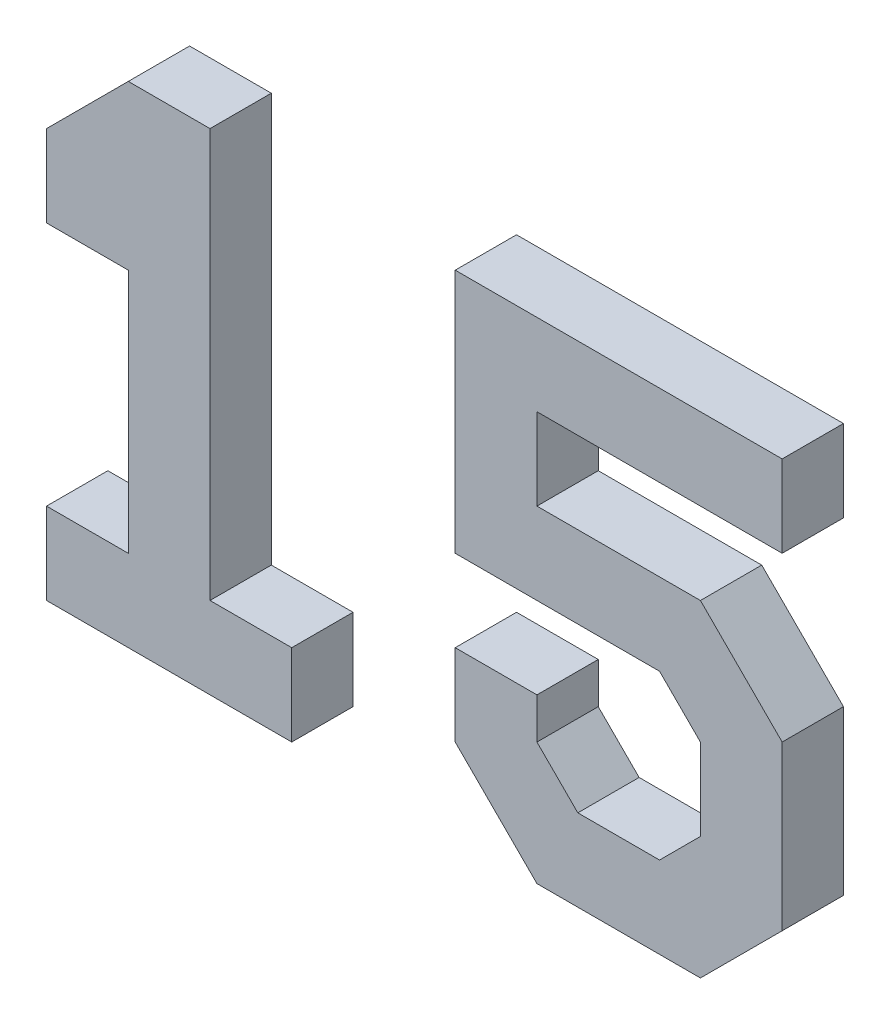
ISO-10303-21;
HEADER;
FILE_DESCRIPTION(('STEP AP214'),'2;1');
FILE_NAME('part.step','',(''),(''),'','','');
FILE_SCHEMA(('AUTOMOTIVE_DESIGN { 1 0 10303 214 1 1 1 1 }'));
ENDSEC;
DATA;
#1=APPLICATION_CONTEXT('core data for automotive mechanical design processes');
#2=APPLICATION_PROTOCOL_DEFINITION('international standard','automotive_design',2000,#1);
#3=PRODUCT_CONTEXT('',#1,'mechanical');
#4=PRODUCT('Part','Part','',(#3));
#5=PRODUCT_RELATED_PRODUCT_CATEGORY('part','',(#4));
#6=PRODUCT_DEFINITION_FORMATION('','',#4);
#7=PRODUCT_DEFINITION_CONTEXT('part definition',#1,'design');
#8=PRODUCT_DEFINITION('design','',#6,#7);
#9=PRODUCT_DEFINITION_SHAPE('','',#8);
#10=(LENGTH_UNIT() NAMED_UNIT(*) SI_UNIT(.MILLI.,.METRE.));
#11=(NAMED_UNIT(*) PLANE_ANGLE_UNIT() SI_UNIT($,.RADIAN.));
#12=(NAMED_UNIT(*) SI_UNIT($,.STERADIAN.) SOLID_ANGLE_UNIT());
#13=UNCERTAINTY_MEASURE_WITH_UNIT(LENGTH_MEASURE(1.E-05),#10,'distance_accuracy_value','');
#14=(GEOMETRIC_REPRESENTATION_CONTEXT(3) GLOBAL_UNCERTAINTY_ASSIGNED_CONTEXT((#13)) GLOBAL_UNIT_ASSIGNED_CONTEXT((#10,
#11,#12)) REPRESENTATION_CONTEXT('',''));
#15=CARTESIAN_POINT('',(0.,0.,0.));
#16=DIRECTION('',(0.,0.,1.));
#17=DIRECTION('',(1.,0.,0.));
#18=AXIS2_PLACEMENT_3D('',#15,#16,#17);
#19=CARTESIAN_POINT('',(90.0000000000001,120.,15.));
#20=DIRECTION('',(0.,1.,0.));
#21=DIRECTION('',(0.,0.,1.));
#22=AXIS2_PLACEMENT_3D('',#19,#20,#21);
#23=PLANE('',#22);
#24=DIRECTION('',(1.,0.,0.));
#25=VECTOR('',#24,1.);
#26=CARTESIAN_POINT('',(90.0000000000001,120.,0.));
#27=LINE('',#26,#25);
#28=CARTESIAN_POINT('',(100.000000000001,120.,0.));
#29=VERTEX_POINT('',#28);
#30=CARTESIAN_POINT('',(180.,120.,0.));
#31=VERTEX_POINT('',#30);
#32=EDGE_CURVE('E184',#29,#31,#27,.T.);
#33=ORIENTED_EDGE('',*,*,#32,.F.);
#34=DIRECTION('',(0.,0.,-1.));
#35=VECTOR('',#34,1.);
#36=CARTESIAN_POINT('',(100.000000000001,120.,15.));
#37=LINE('',#36,#35);
#38=CARTESIAN_POINT('',(100.000000000001,120.,15.));
#39=VERTEX_POINT('',#38);
#40=EDGE_CURVE('E12',#39,#29,#37,.T.);
#41=ORIENTED_EDGE('',*,*,#40,.F.);
#42=DIRECTION('',(1.,0.,0.));
#43=VECTOR('',#42,1.);
#44=CARTESIAN_POINT('',(90.0000000000001,120.,15.));
#45=LINE('',#44,#43);
#46=CARTESIAN_POINT('',(180.,120.,15.));
#47=VERTEX_POINT('',#46);
#48=EDGE_CURVE('E244',#39,#47,#45,.T.);
#49=ORIENTED_EDGE('',*,*,#48,.T.);
#50=DIRECTION('',(0.,0.,-1.));
#51=VECTOR('',#50,1.);
#52=CARTESIAN_POINT('',(180.,120.,15.));
#53=LINE('',#52,#51);
#54=EDGE_CURVE('E185',#47,#31,#53,.T.);
#55=ORIENTED_EDGE('',*,*,#54,.T.);
#56=EDGE_LOOP('',(#33,#41,#49,#55));
#57=FACE_BOUND('',#56,.T.);
#58=ADVANCED_FACE('F40',(#57),#23,.T.);
#59=CARTESIAN_POINT('',(99.9999999999994,-108.4090653048,15.));
#60=DIRECTION('',(-1.,0.,0.));
#61=DIRECTION('',(0.,-1.,0.));
#62=AXIS2_PLACEMENT_3D('',#59,#60,#61);
#63=PLANE('',#62);
#64=DIRECTION('',(0.,1.,0.));
#65=VECTOR('',#64,1.);
#66=CARTESIAN_POINT('',(99.9999999999994,-108.4090653048,0.));
#67=LINE('',#66,#65);
#68=CARTESIAN_POINT('',(100.000000000001,60.,0.));
#69=VERTEX_POINT('',#68);
#70=EDGE_CURVE('E178',#69,#29,#67,.T.);
#71=ORIENTED_EDGE('',*,*,#70,.F.);
#72=DIRECTION('',(0.,0.,-1.));
#73=VECTOR('',#72,1.);
#74=CARTESIAN_POINT('',(100.000000000001,60.,15.));
#75=LINE('',#74,#73);
#76=CARTESIAN_POINT('',(100.000000000001,60.,15.));
#77=VERTEX_POINT('',#76);
#78=EDGE_CURVE('E47',#77,#69,#75,.T.);
#79=ORIENTED_EDGE('',*,*,#78,.F.);
#80=DIRECTION('',(0.,1.,0.));
#81=VECTOR('',#80,1.);
#82=CARTESIAN_POINT('',(99.9999999999994,-108.4090653048,15.));
#83=LINE('',#82,#81);
#84=EDGE_CURVE('E180',#77,#39,#83,.T.);
#85=ORIENTED_EDGE('',*,*,#84,.T.);
#86=ORIENTED_EDGE('',*,*,#40,.T.);
#87=EDGE_LOOP('',(#71,#79,#85,#86));
#88=FACE_BOUND('',#87,.T.);
#89=ADVANCED_FACE('F176',(#88),#63,.T.);
#90=CARTESIAN_POINT('',(90.,60.,15.));
#91=DIRECTION('',(0.,1.,0.));
#92=DIRECTION('',(-1.,0.,0.));
#93=AXIS2_PLACEMENT_3D('',#90,#91,#92);
#94=PLANE('',#93);
#95=DIRECTION('',(1.,0.,0.));
#96=VECTOR('',#95,1.);
#97=CARTESIAN_POINT('',(90.,60.,0.));
#98=LINE('',#97,#96);
#99=CARTESIAN_POINT('',(150.,60.,0.));
#100=VERTEX_POINT('',#99);
#101=EDGE_CURVE('E193',#69,#100,#98,.T.);
#102=ORIENTED_EDGE('',*,*,#101,.T.);
#103=DIRECTION('',(0.,0.,-1.));
#104=VECTOR('',#103,1.);
#105=CARTESIAN_POINT('',(150.,60.,15.));
#106=LINE('',#105,#104);
#107=CARTESIAN_POINT('',(150.,60.,15.));
#108=VERTEX_POINT('',#107);
#109=EDGE_CURVE('E326',#108,#100,#106,.T.);
#110=ORIENTED_EDGE('',*,*,#109,.F.);
#111=DIRECTION('',(1.,0.,0.));
#112=VECTOR('',#111,1.);
#113=CARTESIAN_POINT('',(90.,60.,15.));
#114=LINE('',#113,#112);
#115=EDGE_CURVE('E247',#77,#108,#114,.T.);
#116=ORIENTED_EDGE('',*,*,#115,.F.);
#117=ORIENTED_EDGE('',*,*,#78,.T.);
#118=EDGE_LOOP('',(#102,#110,#116,#117));
#119=FACE_BOUND('',#118,.T.);
#120=ADVANCED_FACE('F330',(#119),#94,.F.);
#121=CARTESIAN_POINT('',(204.2045326524,5.79546734760004,15.));
#122=DIRECTION('',(0.707106781186548,0.707106781186547,0.));
#123=DIRECTION('',(-0.707106781186547,0.707106781186548,0.));
#124=AXIS2_PLACEMENT_3D('',#121,#122,#123);
#125=PLANE('',#124);
#126=DIRECTION('',(0.707106781186547,-0.707106781186548,0.));
#127=VECTOR('',#126,1.);
#128=CARTESIAN_POINT('',(204.2045326524,5.79546734760004,0.));
#129=LINE('',#128,#127);
#130=CARTESIAN_POINT('',(160.,50.,0.));
#131=VERTEX_POINT('',#130);
#132=EDGE_CURVE('E195',#100,#131,#129,.T.);
#133=ORIENTED_EDGE('',*,*,#132,.T.);
#134=DIRECTION('',(0.,0.,-1.));
#135=VECTOR('',#134,1.);
#136=CARTESIAN_POINT('',(160.,50.,15.));
#137=LINE('',#136,#135);
#138=CARTESIAN_POINT('',(160.,50.,15.));
#139=VERTEX_POINT('',#138);
#140=EDGE_CURVE('E324',#139,#131,#137,.T.);
#141=ORIENTED_EDGE('',*,*,#140,.F.);
#142=DIRECTION('',(0.707106781186547,-0.707106781186548,0.));
#143=VECTOR('',#142,1.);
#144=CARTESIAN_POINT('',(204.2045326524,5.79546734760004,15.));
#145=LINE('',#144,#143);
#146=EDGE_CURVE('E249',#108,#139,#145,.T.);
#147=ORIENTED_EDGE('',*,*,#146,.F.);
#148=ORIENTED_EDGE('',*,*,#109,.T.);
#149=EDGE_LOOP('',(#133,#141,#147,#148));
#150=FACE_BOUND('',#149,.T.);
#151=ADVANCED_FACE('F352',(#150),#125,.F.);
#152=CARTESIAN_POINT('',(160.,-108.4090653048,15.));
#153=DIRECTION('',(-1.,0.,0.));
#154=DIRECTION('',(0.,-1.,0.));
#155=AXIS2_PLACEMENT_3D('',#152,#153,#154);
#156=PLANE('',#155);
#157=DIRECTION('',(0.,1.,0.));
#158=VECTOR('',#157,1.);
#159=CARTESIAN_POINT('',(160.,-108.4090653048,0.));
#160=LINE('',#159,#158);
#161=CARTESIAN_POINT('',(160.,30.,0.));
#162=VERTEX_POINT('',#161);
#163=EDGE_CURVE('E200',#162,#131,#160,.T.);
#164=ORIENTED_EDGE('',*,*,#163,.F.);
#165=DIRECTION('',(0.,0.,-1.));
#166=VECTOR('',#165,1.);
#167=CARTESIAN_POINT('',(160.,30.,15.));
#168=LINE('',#167,#166);
#169=CARTESIAN_POINT('',(160.,30.,15.));
#170=VERTEX_POINT('',#169);
#171=EDGE_CURVE('E322',#170,#162,#168,.T.);
#172=ORIENTED_EDGE('',*,*,#171,.F.);
#173=DIRECTION('',(0.,1.,0.));
#174=VECTOR('',#173,1.);
#175=CARTESIAN_POINT('',(160.,-108.4090653048,15.));
#176=LINE('',#175,#174);
#177=EDGE_CURVE('E251',#170,#139,#176,.T.);
#178=ORIENTED_EDGE('',*,*,#177,.T.);
#179=ORIENTED_EDGE('',*,*,#140,.T.);
#180=EDGE_LOOP('',(#164,#172,#178,#179));
#181=FACE_BOUND('',#180,.T.);
#182=ADVANCED_FACE('F357',(#181),#156,.T.);
#183=CARTESIAN_POINT('',(55.7954673476001,-74.2045326523998,15.));
#184=DIRECTION('',(-0.707106781186547,0.707106781186548,0.));
#185=DIRECTION('',(-0.707106781186548,-0.707106781186547,0.));
#186=AXIS2_PLACEMENT_3D('',#183,#184,#185);
#187=PLANE('',#186);
#188=DIRECTION('',(0.707106781186548,0.707106781186547,0.));
#189=VECTOR('',#188,1.);
#190=CARTESIAN_POINT('',(55.7954673476001,-74.2045326523998,0.));
#191=LINE('',#190,#189);
#192=CARTESIAN_POINT('',(150.,20.,0.));
#193=VERTEX_POINT('',#192);
#194=EDGE_CURVE('E203',#193,#162,#191,.T.);
#195=ORIENTED_EDGE('',*,*,#194,.F.);
#196=DIRECTION('',(0.,0.,-1.));
#197=VECTOR('',#196,1.);
#198=CARTESIAN_POINT('',(150.,20.,15.));
#199=LINE('',#198,#197);
#200=CARTESIAN_POINT('',(150.,20.,15.));
#201=VERTEX_POINT('',#200);
#202=EDGE_CURVE('E320',#201,#193,#199,.T.);
#203=ORIENTED_EDGE('',*,*,#202,.F.);
#204=DIRECTION('',(0.707106781186548,0.707106781186547,0.));
#205=VECTOR('',#204,1.);
#206=CARTESIAN_POINT('',(55.7954673476001,-74.2045326523998,15.));
#207=LINE('',#206,#205);
#208=EDGE_CURVE('E254',#201,#170,#207,.T.);
#209=ORIENTED_EDGE('',*,*,#208,.T.);
#210=ORIENTED_EDGE('',*,*,#171,.T.);
#211=EDGE_LOOP('',(#195,#203,#209,#210));
#212=FACE_BOUND('',#211,.T.);
#213=ADVANCED_FACE('F361',(#212),#187,.T.);
#214=CARTESIAN_POINT('',(90.0000000000001,20.,15.));
#215=DIRECTION('',(0.,1.,0.));
#216=DIRECTION('',(-1.,0.,0.));
#217=AXIS2_PLACEMENT_3D('',#214,#215,#216);
#218=PLANE('',#217);
#219=DIRECTION('',(1.,0.,0.));
#220=VECTOR('',#219,1.);
#221=CARTESIAN_POINT('',(90.0000000000001,20.,0.));
#222=LINE('',#221,#220);
#223=CARTESIAN_POINT('',(130.,20.,0.));
#224=VERTEX_POINT('',#223);
#225=EDGE_CURVE('E206',#224,#193,#222,.T.);
#226=ORIENTED_EDGE('',*,*,#225,.F.);
#227=DIRECTION('',(0.,0.,-1.));
#228=VECTOR('',#227,1.);
#229=CARTESIAN_POINT('',(130.,20.,15.));
#230=LINE('',#229,#228);
#231=CARTESIAN_POINT('',(130.,20.,15.));
#232=VERTEX_POINT('',#231);
#233=EDGE_CURVE('E318',#232,#224,#230,.T.);
#234=ORIENTED_EDGE('',*,*,#233,.F.);
#235=DIRECTION('',(1.,0.,0.));
#236=VECTOR('',#235,1.);
#237=CARTESIAN_POINT('',(90.0000000000001,20.,15.));
#238=LINE('',#237,#236);
#239=EDGE_CURVE('E257',#232,#201,#238,.T.);
#240=ORIENTED_EDGE('',*,*,#239,.T.);
#241=ORIENTED_EDGE('',*,*,#202,.T.);
#242=EDGE_LOOP('',(#226,#234,#240,#241));
#243=FACE_BOUND('',#242,.T.);
#244=ADVANCED_FACE('F365',(#243),#218,.T.);
#245=CARTESIAN_POINT('',(174.2045326524,-24.2045326523998,15.));
#246=DIRECTION('',(0.707106781186547,0.707106781186548,0.));
#247=DIRECTION('',(-0.707106781186548,0.707106781186547,0.));
#248=AXIS2_PLACEMENT_3D('',#245,#246,#247);
#249=PLANE('',#248);
#250=DIRECTION('',(0.707106781186548,-0.707106781186547,0.));
#251=VECTOR('',#250,1.);
#252=CARTESIAN_POINT('',(174.2045326524,-24.2045326523998,0.));
#253=LINE('',#252,#251);
#254=CARTESIAN_POINT('',(120.,30.,0.));
#255=VERTEX_POINT('',#254);
#256=EDGE_CURVE('E209',#255,#224,#253,.T.);
#257=ORIENTED_EDGE('',*,*,#256,.F.);
#258=DIRECTION('',(0.,0.,-1.));
#259=VECTOR('',#258,1.);
#260=CARTESIAN_POINT('',(120.,30.,15.));
#261=LINE('',#260,#259);
#262=CARTESIAN_POINT('',(120.,30.,15.));
#263=VERTEX_POINT('',#262);
#264=EDGE_CURVE('E316',#263,#255,#261,.T.);
#265=ORIENTED_EDGE('',*,*,#264,.F.);
#266=DIRECTION('',(0.707106781186548,-0.707106781186547,0.));
#267=VECTOR('',#266,1.);
#268=CARTESIAN_POINT('',(174.2045326524,-24.2045326523998,15.));
#269=LINE('',#268,#267);
#270=EDGE_CURVE('E260',#263,#232,#269,.T.);
#271=ORIENTED_EDGE('',*,*,#270,.T.);
#272=ORIENTED_EDGE('',*,*,#233,.T.);
#273=EDGE_LOOP('',(#257,#265,#271,#272));
#274=FACE_BOUND('',#273,.T.);
#275=ADVANCED_FACE('F369',(#274),#249,.T.);
#276=CARTESIAN_POINT('',(120.,-108.4090653048,15.));
#277=DIRECTION('',(-1.,0.,0.));
#278=DIRECTION('',(0.,0.,1.));
#279=AXIS2_PLACEMENT_3D('',#276,#277,#278);
#280=PLANE('',#279);
#281=DIRECTION('',(0.,1.,0.));
#282=VECTOR('',#281,1.);
#283=CARTESIAN_POINT('',(120.,-108.4090653048,0.));
#284=LINE('',#283,#282);
#285=CARTESIAN_POINT('',(120.,40.,0.));
#286=VERTEX_POINT('',#285);
#287=EDGE_CURVE('E212',#255,#286,#284,.T.);
#288=ORIENTED_EDGE('',*,*,#287,.T.);
#289=DIRECTION('',(0.,0.,-1.));
#290=VECTOR('',#289,1.);
#291=CARTESIAN_POINT('',(120.,40.,15.));
#292=LINE('',#291,#290);
#293=CARTESIAN_POINT('',(120.,40.,15.));
#294=VERTEX_POINT('',#293);
#295=EDGE_CURVE('E314',#294,#286,#292,.T.);
#296=ORIENTED_EDGE('',*,*,#295,.F.);
#297=DIRECTION('',(0.,1.,0.));
#298=VECTOR('',#297,1.);
#299=CARTESIAN_POINT('',(120.,-108.4090653048,15.));
#300=LINE('',#299,#298);
#301=EDGE_CURVE('E263',#263,#294,#300,.T.);
#302=ORIENTED_EDGE('',*,*,#301,.F.);
#303=ORIENTED_EDGE('',*,*,#264,.T.);
#304=EDGE_LOOP('',(#288,#296,#302,#303));
#305=FACE_BOUND('',#304,.T.);
#306=ADVANCED_FACE('F373',(#305),#280,.F.);
#307=CARTESIAN_POINT('',(90.,40.,15.));
#308=DIRECTION('',(0.,1.,0.));
#309=DIRECTION('',(-1.,0.,0.));
#310=AXIS2_PLACEMENT_3D('',#307,#308,#309);
#311=PLANE('',#310);
#312=DIRECTION('',(1.,0.,0.));
#313=VECTOR('',#312,1.);
#314=CARTESIAN_POINT('',(90.,40.,0.));
#315=LINE('',#314,#313);
#316=CARTESIAN_POINT('',(100.000000000001,40.,0.));
#317=VERTEX_POINT('',#316);
#318=EDGE_CURVE('E215',#317,#286,#315,.T.);
#319=ORIENTED_EDGE('',*,*,#318,.F.);
#320=DIRECTION('',(0.,0.,-1.));
#321=VECTOR('',#320,1.);
#322=CARTESIAN_POINT('',(100.000000000001,40.,15.));
#323=LINE('',#322,#321);
#324=CARTESIAN_POINT('',(100.000000000001,40.,15.));
#325=VERTEX_POINT('',#324);
#326=EDGE_CURVE('E312',#325,#317,#323,.T.);
#327=ORIENTED_EDGE('',*,*,#326,.F.);
#328=DIRECTION('',(1.,0.,0.));
#329=VECTOR('',#328,1.);
#330=CARTESIAN_POINT('',(90.,40.,15.));
#331=LINE('',#330,#329);
#332=EDGE_CURVE('E265',#325,#294,#331,.T.);
#333=ORIENTED_EDGE('',*,*,#332,.T.);
#334=ORIENTED_EDGE('',*,*,#295,.T.);
#335=EDGE_LOOP('',(#319,#327,#333,#334));
#336=FACE_BOUND('',#335,.T.);
#337=ADVANCED_FACE('F377',(#336),#311,.T.);
#338=CARTESIAN_POINT('',(99.9999999999994,-108.4090653048,15.));
#339=DIRECTION('',(-1.,0.,0.));
#340=DIRECTION('',(0.,-1.,0.));
#341=AXIS2_PLACEMENT_3D('',#338,#339,#340);
#342=PLANE('',#341);
#343=DIRECTION('',(0.,1.,0.));
#344=VECTOR('',#343,1.);
#345=CARTESIAN_POINT('',(99.9999999999994,-108.4090653048,0.));
#346=LINE('',#345,#344);
#347=CARTESIAN_POINT('',(100.,20.,0.));
#348=VERTEX_POINT('',#347);
#349=EDGE_CURVE('E218',#348,#317,#346,.T.);
#350=ORIENTED_EDGE('',*,*,#349,.F.);
#351=DIRECTION('',(0.,0.,-1.));
#352=VECTOR('',#351,1.);
#353=CARTESIAN_POINT('',(100.,20.,15.));
#354=LINE('',#353,#352);
#355=CARTESIAN_POINT('',(100.,20.,15.));
#356=VERTEX_POINT('',#355);
#357=EDGE_CURVE('E310',#356,#348,#354,.T.);
#358=ORIENTED_EDGE('',*,*,#357,.F.);
#359=DIRECTION('',(0.,1.,0.));
#360=VECTOR('',#359,1.);
#361=CARTESIAN_POINT('',(99.9999999999994,-108.4090653048,15.));
#362=LINE('',#361,#360);
#363=EDGE_CURVE('E268',#356,#325,#362,.T.);
#364=ORIENTED_EDGE('',*,*,#363,.T.);
#365=ORIENTED_EDGE('',*,*,#326,.T.);
#366=EDGE_LOOP('',(#350,#358,#364,#365));
#367=FACE_BOUND('',#366,.T.);
#368=ADVANCED_FACE('F381',(#367),#342,.T.);
#369=CARTESIAN_POINT('',(159.2045326524,-39.2045326524011,15.));
#370=DIRECTION('',(-0.707106781186555,-0.70710678118654,0.));
#371=DIRECTION('',(0.70710678118654,-0.707106781186555,0.));
#372=AXIS2_PLACEMENT_3D('',#369,#370,#371);
#373=PLANE('',#372);
#374=DIRECTION('',(-0.70710678118654,0.707106781186555,0.));
#375=VECTOR('',#374,1.);
#376=CARTESIAN_POINT('',(159.2045326524,-39.2045326524011,0.));
#377=LINE('',#376,#375);
#378=CARTESIAN_POINT('',(120.,0.,0.));
#379=VERTEX_POINT('',#378);
#380=EDGE_CURVE('E221',#379,#348,#377,.T.);
#381=ORIENTED_EDGE('',*,*,#380,.F.);
#382=DIRECTION('',(0.,0.,-1.));
#383=VECTOR('',#382,1.);
#384=CARTESIAN_POINT('',(120.,0.,15.));
#385=LINE('',#384,#383);
#386=CARTESIAN_POINT('',(120.,0.,15.));
#387=VERTEX_POINT('',#386);
#388=EDGE_CURVE('E308',#387,#379,#385,.T.);
#389=ORIENTED_EDGE('',*,*,#388,.F.);
#390=DIRECTION('',(-0.70710678118654,0.707106781186555,0.));
#391=VECTOR('',#390,1.);
#392=CARTESIAN_POINT('',(159.2045326524,-39.2045326524011,15.));
#393=LINE('',#392,#391);
#394=EDGE_CURVE('E271',#387,#356,#393,.T.);
#395=ORIENTED_EDGE('',*,*,#394,.T.);
#396=ORIENTED_EDGE('',*,*,#357,.T.);
#397=EDGE_LOOP('',(#381,#389,#395,#396));
#398=FACE_BOUND('',#397,.T.);
#399=ADVANCED_FACE('F385',(#398),#373,.T.);
#400=CARTESIAN_POINT('',(90.0000000000001,0.,15.));
#401=DIRECTION('',(0.,1.,0.));
#402=DIRECTION('',(0.,0.,1.));
#403=AXIS2_PLACEMENT_3D('',#400,#401,#402);
#404=PLANE('',#403);
#405=DIRECTION('',(1.,0.,0.));
#406=VECTOR('',#405,1.);
#407=CARTESIAN_POINT('',(90.0000000000001,0.,0.));
#408=LINE('',#407,#406);
#409=CARTESIAN_POINT('',(160.,0.,0.));
#410=VERTEX_POINT('',#409);
#411=EDGE_CURVE('E224',#379,#410,#408,.T.);
#412=ORIENTED_EDGE('',*,*,#411,.T.);
#413=DIRECTION('',(0.,0.,-1.));
#414=VECTOR('',#413,1.);
#415=CARTESIAN_POINT('',(160.,0.,15.));
#416=LINE('',#415,#414);
#417=CARTESIAN_POINT('',(160.,0.,15.));
#418=VERTEX_POINT('',#417);
#419=EDGE_CURVE('E306',#418,#410,#416,.T.);
#420=ORIENTED_EDGE('',*,*,#419,.F.);
#421=DIRECTION('',(1.,0.,0.));
#422=VECTOR('',#421,1.);
#423=CARTESIAN_POINT('',(90.0000000000001,0.,15.));
#424=LINE('',#423,#422);
#425=EDGE_CURVE('E274',#387,#418,#424,.T.);
#426=ORIENTED_EDGE('',*,*,#425,.F.);
#427=ORIENTED_EDGE('',*,*,#388,.T.);
#428=EDGE_LOOP('',(#412,#420,#426,#427));
#429=FACE_BOUND('',#428,.T.);
#430=ADVANCED_FACE('F389',(#429),#404,.F.);
#431=CARTESIAN_POINT('',(70.7954673475994,-89.2045326523987,15.));
#432=DIRECTION('',(0.70710678118654,-0.707106781186555,0.));
#433=DIRECTION('',(0.707106781186555,0.70710678118654,0.));
#434=AXIS2_PLACEMENT_3D('',#431,#432,#433);
#435=PLANE('',#434);
#436=DIRECTION('',(-0.707106781186555,-0.70710678118654,0.));
#437=VECTOR('',#436,1.);
#438=CARTESIAN_POINT('',(70.7954673475994,-89.2045326523987,0.));
#439=LINE('',#438,#437);
#440=CARTESIAN_POINT('',(180.,20.,0.));
#441=VERTEX_POINT('',#440);
#442=EDGE_CURVE('E227',#441,#410,#439,.T.);
#443=ORIENTED_EDGE('',*,*,#442,.F.);
#444=DIRECTION('',(0.,0.,-1.));
#445=VECTOR('',#444,1.);
#446=CARTESIAN_POINT('',(180.,20.,15.));
#447=LINE('',#446,#445);
#448=CARTESIAN_POINT('',(180.,20.,15.));
#449=VERTEX_POINT('',#448);
#450=EDGE_CURVE('E304',#449,#441,#447,.T.);
#451=ORIENTED_EDGE('',*,*,#450,.F.);
#452=DIRECTION('',(-0.707106781186555,-0.70710678118654,0.));
#453=VECTOR('',#452,1.);
#454=CARTESIAN_POINT('',(70.7954673475994,-89.2045326523987,15.));
#455=LINE('',#454,#453);
#456=EDGE_CURVE('E276',#449,#418,#455,.T.);
#457=ORIENTED_EDGE('',*,*,#456,.T.);
#458=ORIENTED_EDGE('',*,*,#419,.T.);
#459=EDGE_LOOP('',(#443,#451,#457,#458));
#460=FACE_BOUND('',#459,.T.);
#461=ADVANCED_FACE('F393',(#460),#435,.T.);
#462=CARTESIAN_POINT('',(180.000000000003,-108.409065304798,15.));
#463=DIRECTION('',(-1.,0.,0.));
#464=DIRECTION('',(0.,-1.,0.));
#465=AXIS2_PLACEMENT_3D('',#462,#463,#464);
#466=PLANE('',#465);
#467=DIRECTION('',(0.,1.,0.));
#468=VECTOR('',#467,1.);
#469=CARTESIAN_POINT('',(180.000000000003,-108.409065304798,0.));
#470=LINE('',#469,#468);
#471=CARTESIAN_POINT('',(180.,60.,0.));
#472=VERTEX_POINT('',#471);
#473=EDGE_CURVE('E230',#441,#472,#470,.T.);
#474=ORIENTED_EDGE('',*,*,#473,.T.);
#475=DIRECTION('',(0.,0.,-1.));
#476=VECTOR('',#475,1.);
#477=CARTESIAN_POINT('',(180.,60.,15.));
#478=LINE('',#477,#476);
#479=CARTESIAN_POINT('',(180.,60.,15.));
#480=VERTEX_POINT('',#479);
#481=EDGE_CURVE('E301',#480,#472,#478,.T.);
#482=ORIENTED_EDGE('',*,*,#481,.F.);
#483=DIRECTION('',(0.,1.,0.));
#484=VECTOR('',#483,1.);
#485=CARTESIAN_POINT('',(180.000000000003,-108.409065304798,15.));
#486=LINE('',#485,#484);
#487=EDGE_CURVE('E279',#449,#480,#486,.T.);
#488=ORIENTED_EDGE('',*,*,#487,.F.);
#489=ORIENTED_EDGE('',*,*,#450,.T.);
#490=EDGE_LOOP('',(#474,#482,#488,#489));
#491=FACE_BOUND('',#490,.T.);
#492=ADVANCED_FACE('F397',(#491),#466,.F.);
#493=CARTESIAN_POINT('',(219.2045326524,20.7954673475991,15.));
#494=DIRECTION('',(-0.707106781186551,-0.707106781186544,0.));
#495=DIRECTION('',(0.707106781186544,-0.707106781186551,0.));
#496=AXIS2_PLACEMENT_3D('',#493,#494,#495);
#497=PLANE('',#496);
#498=DIRECTION('',(-0.707106781186544,0.707106781186551,0.));
#499=VECTOR('',#498,1.);
#500=CARTESIAN_POINT('',(219.2045326524,20.7954673475991,0.));
#501=LINE('',#500,#499);
#502=CARTESIAN_POINT('',(160.,80.,0.));
#503=VERTEX_POINT('',#502);
#504=EDGE_CURVE('E232',#472,#503,#501,.T.);
#505=ORIENTED_EDGE('',*,*,#504,.T.);
#506=DIRECTION('',(0.,0.,-1.));
#507=VECTOR('',#506,1.);
#508=CARTESIAN_POINT('',(160.,80.,15.));
#509=LINE('',#508,#507);
#510=CARTESIAN_POINT('',(160.,80.,15.));
#511=VERTEX_POINT('',#510);
#512=EDGE_CURVE('E299',#511,#503,#509,.T.);
#513=ORIENTED_EDGE('',*,*,#512,.F.);
#514=DIRECTION('',(-0.707106781186544,0.707106781186551,0.));
#515=VECTOR('',#514,1.);
#516=CARTESIAN_POINT('',(219.2045326524,20.7954673475991,15.));
#517=LINE('',#516,#515);
#518=EDGE_CURVE('E281',#480,#511,#517,.T.);
#519=ORIENTED_EDGE('',*,*,#518,.F.);
#520=ORIENTED_EDGE('',*,*,#481,.T.);
#521=EDGE_LOOP('',(#505,#513,#519,#520));
#522=FACE_BOUND('',#521,.T.);
#523=ADVANCED_FACE('F401',(#522),#497,.F.);
#524=CARTESIAN_POINT('',(89.9999999999999,80.,15.));
#525=DIRECTION('',(0.,1.,0.));
#526=DIRECTION('',(-1.,0.,0.));
#527=AXIS2_PLACEMENT_3D('',#524,#525,#526);
#528=PLANE('',#527);
#529=DIRECTION('',(1.,0.,0.));
#530=VECTOR('',#529,1.);
#531=CARTESIAN_POINT('',(89.9999999999999,80.,0.));
#532=LINE('',#531,#530);
#533=CARTESIAN_POINT('',(120.,80.,0.));
#534=VERTEX_POINT('',#533);
#535=EDGE_CURVE('E235',#534,#503,#532,.T.);
#536=ORIENTED_EDGE('',*,*,#535,.F.);
#537=DIRECTION('',(0.,0.,-1.));
#538=VECTOR('',#537,1.);
#539=CARTESIAN_POINT('',(120.,80.,15.));
#540=LINE('',#539,#538);
#541=CARTESIAN_POINT('',(120.,80.,15.));
#542=VERTEX_POINT('',#541);
#543=EDGE_CURVE('E297',#542,#534,#540,.T.);
#544=ORIENTED_EDGE('',*,*,#543,.F.);
#545=DIRECTION('',(1.,0.,0.));
#546=VECTOR('',#545,1.);
#547=CARTESIAN_POINT('',(89.9999999999999,80.,15.));
#548=LINE('',#547,#546);
#549=EDGE_CURVE('E283',#542,#511,#548,.T.);
#550=ORIENTED_EDGE('',*,*,#549,.T.);
#551=ORIENTED_EDGE('',*,*,#512,.T.);
#552=EDGE_LOOP('',(#536,#544,#550,#551));
#553=FACE_BOUND('',#552,.T.);
#554=ADVANCED_FACE('F405',(#553),#528,.T.);
#555=CARTESIAN_POINT('',(120.,-108.4090653048,15.));
#556=DIRECTION('',(-1.,0.,0.));
#557=DIRECTION('',(0.,0.,1.));
#558=AXIS2_PLACEMENT_3D('',#555,#556,#557);
#559=PLANE('',#558);
#560=DIRECTION('',(0.,1.,0.));
#561=VECTOR('',#560,1.);
#562=CARTESIAN_POINT('',(120.,-108.4090653048,0.));
#563=LINE('',#562,#561);
#564=CARTESIAN_POINT('',(120.,99.9999999999999,0.));
#565=VERTEX_POINT('',#564);
#566=EDGE_CURVE('E238',#534,#565,#563,.T.);
#567=ORIENTED_EDGE('',*,*,#566,.T.);
#568=DIRECTION('',(0.,0.,-1.));
#569=VECTOR('',#568,1.);
#570=CARTESIAN_POINT('',(120.,99.9999999999999,15.));
#571=LINE('',#570,#569);
#572=CARTESIAN_POINT('',(120.,99.9999999999999,15.));
#573=VERTEX_POINT('',#572);
#574=EDGE_CURVE('E294',#573,#565,#571,.T.);
#575=ORIENTED_EDGE('',*,*,#574,.F.);
#576=DIRECTION('',(0.,1.,0.));
#577=VECTOR('',#576,1.);
#578=CARTESIAN_POINT('',(120.,-108.4090653048,15.));
#579=LINE('',#578,#577);
#580=EDGE_CURVE('E286',#542,#573,#579,.T.);
#581=ORIENTED_EDGE('',*,*,#580,.F.);
#582=ORIENTED_EDGE('',*,*,#543,.T.);
#583=EDGE_LOOP('',(#567,#575,#581,#582));
#584=FACE_BOUND('',#583,.T.);
#585=ADVANCED_FACE('F409',(#584),#559,.F.);
#586=CARTESIAN_POINT('',(89.9999999999999,99.9999999999999,15.));
#587=DIRECTION('',(0.,1.,0.));
#588=DIRECTION('',(-1.,0.,0.));
#589=AXIS2_PLACEMENT_3D('',#586,#587,#588);
#590=PLANE('',#589);
#591=DIRECTION('',(1.,0.,0.));
#592=VECTOR('',#591,1.);
#593=CARTESIAN_POINT('',(89.9999999999999,99.9999999999999,0.));
#594=LINE('',#593,#592);
#595=CARTESIAN_POINT('',(180.,100.,0.));
#596=VERTEX_POINT('',#595);
#597=EDGE_CURVE('E240',#565,#596,#594,.T.);
#598=ORIENTED_EDGE('',*,*,#597,.T.);
#599=DIRECTION('',(0.,0.,-1.));
#600=VECTOR('',#599,1.);
#601=CARTESIAN_POINT('',(180.,100.,15.));
#602=LINE('',#601,#600);
#603=CARTESIAN_POINT('',(180.,100.,15.));
#604=VERTEX_POINT('',#603);
#605=EDGE_CURVE('E291',#604,#596,#602,.T.);
#606=ORIENTED_EDGE('',*,*,#605,.F.);
#607=DIRECTION('',(1.,0.,0.));
#608=VECTOR('',#607,1.);
#609=CARTESIAN_POINT('',(89.9999999999999,99.9999999999999,15.));
#610=LINE('',#609,#608);
#611=EDGE_CURVE('E59',#573,#604,#610,.T.);
#612=ORIENTED_EDGE('',*,*,#611,.F.);
#613=ORIENTED_EDGE('',*,*,#574,.T.);
#614=EDGE_LOOP('',(#598,#606,#612,#613));
#615=FACE_BOUND('',#614,.T.);
#616=ADVANCED_FACE('F342',(#615),#590,.F.);
#617=CARTESIAN_POINT('',(179.999999999996,-108.409065304801,15.));
#618=DIRECTION('',(-1.,0.,0.));
#619=DIRECTION('',(0.,-1.,0.));
#620=AXIS2_PLACEMENT_3D('',#617,#618,#619);
#621=PLANE('',#620);
#622=DIRECTION('',(0.,1.,0.));
#623=VECTOR('',#622,1.);
#624=CARTESIAN_POINT('',(179.999999999996,-108.409065304801,0.));
#625=LINE('',#624,#623);
#626=EDGE_CURVE('E242',#596,#31,#625,.T.);
#627=ORIENTED_EDGE('',*,*,#626,.T.);
#628=ORIENTED_EDGE('',*,*,#54,.F.);
#629=DIRECTION('',(0.,1.,0.));
#630=VECTOR('',#629,1.);
#631=CARTESIAN_POINT('',(179.999999999996,-108.409065304801,15.));
#632=LINE('',#631,#630);
#633=EDGE_CURVE('E54',#604,#47,#632,.T.);
#634=ORIENTED_EDGE('',*,*,#633,.F.);
#635=ORIENTED_EDGE('',*,*,#605,.T.);
#636=EDGE_LOOP('',(#627,#628,#634,#635));
#637=FACE_BOUND('',#636,.T.);
#638=ADVANCED_FACE('F335',(#637),#621,.F.);
#639=CARTESIAN_POINT('',(90.0000000000001,-108.4090653048,15.));
#640=DIRECTION('',(0.,0.,1.));
#641=DIRECTION('',(1.,0.,0.));
#642=AXIS2_PLACEMENT_3D('',#639,#640,#641);
#643=PLANE('',#642);
#644=ORIENTED_EDGE('',*,*,#48,.F.);
#645=ORIENTED_EDGE('',*,*,#84,.F.);
#646=ORIENTED_EDGE('',*,*,#115,.T.);
#647=ORIENTED_EDGE('',*,*,#146,.T.);
#648=ORIENTED_EDGE('',*,*,#177,.F.);
#649=ORIENTED_EDGE('',*,*,#208,.F.);
#650=ORIENTED_EDGE('',*,*,#239,.F.);
#651=ORIENTED_EDGE('',*,*,#270,.F.);
#652=ORIENTED_EDGE('',*,*,#301,.T.);
#653=ORIENTED_EDGE('',*,*,#332,.F.);
#654=ORIENTED_EDGE('',*,*,#363,.F.);
#655=ORIENTED_EDGE('',*,*,#394,.F.);
#656=ORIENTED_EDGE('',*,*,#425,.T.);
#657=ORIENTED_EDGE('',*,*,#456,.F.);
#658=ORIENTED_EDGE('',*,*,#487,.T.);
#659=ORIENTED_EDGE('',*,*,#518,.T.);
#660=ORIENTED_EDGE('',*,*,#549,.F.);
#661=ORIENTED_EDGE('',*,*,#580,.T.);
#662=ORIENTED_EDGE('',*,*,#611,.T.);
#663=ORIENTED_EDGE('',*,*,#633,.T.);
#664=EDGE_LOOP('',(#644,#645,#646,#647,#648,#649,#650,#651,#652,#653,#654,#655,#656,#657,#658,
#659,#660,#661,#662,#663));
#665=FACE_BOUND('',#664,.T.);
#666=ADVANCED_FACE('F333',(#665),#643,.T.);
#667=CARTESIAN_POINT('',(90.0000000000001,-108.4090653048,0.));
#668=DIRECTION('',(0.,0.,1.));
#669=DIRECTION('',(1.,0.,0.));
#670=AXIS2_PLACEMENT_3D('',#667,#668,#669);
#671=PLANE('',#670);
#672=ORIENTED_EDGE('',*,*,#32,.T.);
#673=ORIENTED_EDGE('',*,*,#626,.F.);
#674=ORIENTED_EDGE('',*,*,#597,.F.);
#675=ORIENTED_EDGE('',*,*,#566,.F.);
#676=ORIENTED_EDGE('',*,*,#535,.T.);
#677=ORIENTED_EDGE('',*,*,#504,.F.);
#678=ORIENTED_EDGE('',*,*,#473,.F.);
#679=ORIENTED_EDGE('',*,*,#442,.T.);
#680=ORIENTED_EDGE('',*,*,#411,.F.);
#681=ORIENTED_EDGE('',*,*,#380,.T.);
#682=ORIENTED_EDGE('',*,*,#349,.T.);
#683=ORIENTED_EDGE('',*,*,#318,.T.);
#684=ORIENTED_EDGE('',*,*,#287,.F.);
#685=ORIENTED_EDGE('',*,*,#256,.T.);
#686=ORIENTED_EDGE('',*,*,#225,.T.);
#687=ORIENTED_EDGE('',*,*,#194,.T.);
#688=ORIENTED_EDGE('',*,*,#163,.T.);
#689=ORIENTED_EDGE('',*,*,#132,.F.);
#690=ORIENTED_EDGE('',*,*,#101,.F.);
#691=ORIENTED_EDGE('',*,*,#70,.T.);
#692=EDGE_LOOP('',(#672,#673,#674,#675,#676,#677,#678,#679,#680,#681,#682,#683,#684,#685,#686,
#687,#688,#689,#690,#691));
#693=FACE_BOUND('',#692,.T.);
#694=ADVANCED_FACE('F191',(#693),#671,.F.);
#695=CLOSED_SHELL('',(#58,#89,#120,#151,#182,#213,#244,#275,#306,#337,#368,#399,#430,#461,#492,
#523,#554,#585,#616,#638,#666,#694));
#696=MANIFOLD_SOLID_BREP('B2',#695);
#697=CARTESIAN_POINT('',(90.0000000000026,119.999999999999,15.));
#698=DIRECTION('',(0.,1.,0.));
#699=DIRECTION('',(-1.,0.,0.));
#700=AXIS2_PLACEMENT_3D('',#697,#698,#699);
#701=PLANE('',#700);
#702=DIRECTION('',(1.,0.,0.));
#703=VECTOR('',#702,1.);
#704=CARTESIAN_POINT('',(90.0000000000026,119.999999999999,0.));
#705=LINE('',#704,#703);
#706=CARTESIAN_POINT('',(20.0000000000002,120.,0.));
#707=VERTEX_POINT('',#706);
#708=CARTESIAN_POINT('',(40.,120.,0.));
#709=VERTEX_POINT('',#708);
#710=EDGE_CURVE('E675',#707,#709,#705,.T.);
#711=ORIENTED_EDGE('',*,*,#710,.F.);
#712=DIRECTION('',(0.,0.,-1.));
#713=VECTOR('',#712,1.);
#714=CARTESIAN_POINT('',(20.0000000000002,120.,15.));
#715=LINE('',#714,#713);
#716=CARTESIAN_POINT('',(20.0000000000002,120.,15.));
#717=VERTEX_POINT('',#716);
#718=EDGE_CURVE('E38',#717,#707,#715,.T.);
#719=ORIENTED_EDGE('',*,*,#718,.F.);
#720=DIRECTION('',(1.,0.,0.));
#721=VECTOR('',#720,1.);
#722=CARTESIAN_POINT('',(90.0000000000026,119.999999999999,15.));
#723=LINE('',#722,#721);
#724=CARTESIAN_POINT('',(40.,120.,15.));
#725=VERTEX_POINT('',#724);
#726=EDGE_CURVE('E707',#717,#725,#723,.T.);
#727=ORIENTED_EDGE('',*,*,#726,.T.);
#728=DIRECTION('',(0.,0.,-1.));
#729=VECTOR('',#728,1.);
#730=CARTESIAN_POINT('',(40.,120.,15.));
#731=LINE('',#730,#729);
#732=EDGE_CURVE('E680',#725,#709,#731,.T.);
#733=ORIENTED_EDGE('',*,*,#732,.T.);
#734=EDGE_LOOP('',(#711,#719,#727,#733));
#735=FACE_BOUND('',#734,.T.);
#736=ADVANCED_FACE('F579',(#735),#701,.T.);
#737=CARTESIAN_POINT('',(-59.2045326523982,40.7954673476045,15.));
#738=DIRECTION('',(0.707106781186533,-0.707106781186561,0.));
#739=DIRECTION('',(0.707106781186562,0.707106781186534,0.));
#740=AXIS2_PLACEMENT_3D('',#737,#738,#739);
#741=PLANE('',#740);
#742=DIRECTION('',(-0.707106781186562,-0.707106781186534,0.));
#743=VECTOR('',#742,1.);
#744=CARTESIAN_POINT('',(-59.2045326523982,40.7954673476045,0.));
#745=LINE('',#744,#743);
#746=CARTESIAN_POINT('',(-3.52956513005078E-13,100.,0.));
#747=VERTEX_POINT('',#746);
#748=EDGE_CURVE('E665',#707,#747,#745,.T.);
#749=ORIENTED_EDGE('',*,*,#748,.T.);
#750=DIRECTION('',(0.,0.,-1.));
#751=VECTOR('',#750,1.);
#752=CARTESIAN_POINT('',(-3.52956513005078E-13,100.,15.));
#753=LINE('',#752,#751);
#754=CARTESIAN_POINT('',(-3.52956513005078E-13,100.,15.));
#755=VERTEX_POINT('',#754);
#756=EDGE_CURVE('E586',#755,#747,#753,.T.);
#757=ORIENTED_EDGE('',*,*,#756,.F.);
#758=DIRECTION('',(-0.707106781186562,-0.707106781186534,0.));
#759=VECTOR('',#758,1.);
#760=CARTESIAN_POINT('',(-59.2045326523982,40.7954673476045,15.));
#761=LINE('',#760,#759);
#762=EDGE_CURVE('E667',#717,#755,#761,.T.);
#763=ORIENTED_EDGE('',*,*,#762,.F.);
#764=ORIENTED_EDGE('',*,*,#718,.T.);
#765=EDGE_LOOP('',(#749,#757,#763,#764));
#766=FACE_BOUND('',#765,.T.);
#767=ADVANCED_FACE('F663',(#766),#741,.F.);
#768=CARTESIAN_POINT('',(3.7470027081099E-13,-108.4090653048,15.));
#769=DIRECTION('',(-1.,0.,0.));
#770=DIRECTION('',(0.,-1.,0.));
#771=AXIS2_PLACEMENT_3D('',#768,#769,#770);
#772=PLANE('',#771);
#773=DIRECTION('',(0.,1.,0.));
#774=VECTOR('',#773,1.);
#775=CARTESIAN_POINT('',(3.7470027081099E-13,-108.4090653048,0.));
#776=LINE('',#775,#774);
#777=CARTESIAN_POINT('',(-2.8312684578289E-13,80.,0.));
#778=VERTEX_POINT('',#777);
#779=EDGE_CURVE('E678',#778,#747,#776,.T.);
#780=ORIENTED_EDGE('',*,*,#779,.F.);
#781=DIRECTION('',(0.,0.,-1.));
#782=VECTOR('',#781,1.);
#783=CARTESIAN_POINT('',(-2.8312684578289E-13,80.,15.));
#784=LINE('',#783,#782);
#785=CARTESIAN_POINT('',(-2.8312684578289E-13,80.,15.));
#786=VERTEX_POINT('',#785);
#787=EDGE_CURVE('E746',#786,#778,#784,.T.);
#788=ORIENTED_EDGE('',*,*,#787,.F.);
#789=DIRECTION('',(0.,1.,0.));
#790=VECTOR('',#789,1.);
#791=CARTESIAN_POINT('',(3.7470027081099E-13,-108.4090653048,15.));
#792=LINE('',#791,#790);
#793=EDGE_CURVE('E710',#786,#755,#792,.T.);
#794=ORIENTED_EDGE('',*,*,#793,.T.);
#795=ORIENTED_EDGE('',*,*,#756,.T.);
#796=EDGE_LOOP('',(#780,#788,#794,#795));
#797=FACE_BOUND('',#796,.T.);
#798=ADVANCED_FACE('F748',(#797),#772,.T.);
#799=CARTESIAN_POINT('',(90.0000000000002,79.9999999999999,15.));
#800=DIRECTION('',(0.,1.,0.));
#801=DIRECTION('',(-1.,0.,0.));
#802=AXIS2_PLACEMENT_3D('',#799,#800,#801);
#803=PLANE('',#802);
#804=DIRECTION('',(1.,0.,0.));
#805=VECTOR('',#804,1.);
#806=CARTESIAN_POINT('',(90.0000000000002,79.9999999999999,0.));
#807=LINE('',#806,#805);
#808=CARTESIAN_POINT('',(20.,80.,0.));
#809=VERTEX_POINT('',#808);
#810=EDGE_CURVE('E685',#778,#809,#807,.T.);
#811=ORIENTED_EDGE('',*,*,#810,.T.);
#812=DIRECTION('',(0.,0.,-1.));
#813=VECTOR('',#812,1.);
#814=CARTESIAN_POINT('',(20.,80.,15.));
#815=LINE('',#814,#813);
#816=CARTESIAN_POINT('',(20.,80.,15.));
#817=VERTEX_POINT('',#816);
#818=EDGE_CURVE('E744',#817,#809,#815,.T.);
#819=ORIENTED_EDGE('',*,*,#818,.F.);
#820=DIRECTION('',(1.,0.,0.));
#821=VECTOR('',#820,1.);
#822=CARTESIAN_POINT('',(90.0000000000002,79.9999999999999,15.));
#823=LINE('',#822,#821);
#824=EDGE_CURVE('E713',#786,#817,#823,.T.);
#825=ORIENTED_EDGE('',*,*,#824,.F.);
#826=ORIENTED_EDGE('',*,*,#787,.T.);
#827=EDGE_LOOP('',(#811,#819,#825,#826));
#828=FACE_BOUND('',#827,.T.);
#829=ADVANCED_FACE('F756',(#828),#803,.F.);
#830=CARTESIAN_POINT('',(20.,-108.4090653048,15.));
#831=DIRECTION('',(-1.,0.,0.));
#832=DIRECTION('',(0.,-1.,0.));
#833=AXIS2_PLACEMENT_3D('',#830,#831,#832);
#834=PLANE('',#833);
#835=DIRECTION('',(0.,1.,0.));
#836=VECTOR('',#835,1.);
#837=CARTESIAN_POINT('',(20.,-108.4090653048,0.));
#838=LINE('',#837,#836);
#839=CARTESIAN_POINT('',(20.,20.,0.));
#840=VERTEX_POINT('',#839);
#841=EDGE_CURVE('E688',#840,#809,#838,.T.);
#842=ORIENTED_EDGE('',*,*,#841,.F.);
#843=DIRECTION('',(0.,0.,-1.));
#844=VECTOR('',#843,1.);
#845=CARTESIAN_POINT('',(20.,20.,15.));
#846=LINE('',#845,#844);
#847=CARTESIAN_POINT('',(20.,20.,15.));
#848=VERTEX_POINT('',#847);
#849=EDGE_CURVE('E742',#848,#840,#846,.T.);
#850=ORIENTED_EDGE('',*,*,#849,.F.);
#851=DIRECTION('',(0.,1.,0.));
#852=VECTOR('',#851,1.);
#853=CARTESIAN_POINT('',(20.,-108.4090653048,15.));
#854=LINE('',#853,#852);
#855=EDGE_CURVE('E715',#848,#817,#854,.T.);
#856=ORIENTED_EDGE('',*,*,#855,.T.);
#857=ORIENTED_EDGE('',*,*,#818,.T.);
#858=EDGE_LOOP('',(#842,#850,#856,#857));
#859=FACE_BOUND('',#858,.T.);
#860=ADVANCED_FACE('F759',(#859),#834,.T.);
#861=CARTESIAN_POINT('',(90.0000000000001,20.,15.));
#862=DIRECTION('',(0.,1.,0.));
#863=DIRECTION('',(0.,0.,1.));
#864=AXIS2_PLACEMENT_3D('',#861,#862,#863);
#865=PLANE('',#864);
#866=DIRECTION('',(1.,0.,0.));
#867=VECTOR('',#866,1.);
#868=CARTESIAN_POINT('',(90.0000000000001,20.,0.));
#869=LINE('',#868,#867);
#870=CARTESIAN_POINT('',(0.,20.,0.));
#871=VERTEX_POINT('',#870);
#872=EDGE_CURVE('E691',#871,#840,#869,.T.);
#873=ORIENTED_EDGE('',*,*,#872,.F.);
#874=DIRECTION('',(0.,0.,-1.));
#875=VECTOR('',#874,1.);
#876=CARTESIAN_POINT('',(0.,20.,15.));
#877=LINE('',#876,#875);
#878=CARTESIAN_POINT('',(0.,20.,15.));
#879=VERTEX_POINT('',#878);
#880=EDGE_CURVE('E740',#879,#871,#877,.T.);
#881=ORIENTED_EDGE('',*,*,#880,.F.);
#882=DIRECTION('',(1.,0.,0.));
#883=VECTOR('',#882,1.);
#884=CARTESIAN_POINT('',(90.0000000000001,20.,15.));
#885=LINE('',#884,#883);
#886=EDGE_CURVE('E718',#879,#848,#885,.T.);
#887=ORIENTED_EDGE('',*,*,#886,.T.);
#888=ORIENTED_EDGE('',*,*,#849,.T.);
#889=EDGE_LOOP('',(#873,#881,#887,#888));
#890=FACE_BOUND('',#889,.T.);
#891=ADVANCED_FACE('F762',(#890),#865,.T.);
#892=CARTESIAN_POINT('',(3.7470027081099E-13,-108.4090653048,15.));
#893=DIRECTION('',(-1.,0.,0.));
#894=DIRECTION('',(0.,-1.,0.));
#895=AXIS2_PLACEMENT_3D('',#892,#893,#894);
#896=PLANE('',#895);
#897=DIRECTION('',(0.,1.,0.));
#898=VECTOR('',#897,1.);
#899=CARTESIAN_POINT('',(3.7470027081099E-13,-108.4090653048,0.));
#900=LINE('',#899,#898);
#901=CARTESIAN_POINT('',(0.,0.,0.));
#902=VERTEX_POINT('',#901);
#903=EDGE_CURVE('E694',#902,#871,#900,.T.);
#904=ORIENTED_EDGE('',*,*,#903,.F.);
#905=DIRECTION('',(0.,0.,-1.));
#906=VECTOR('',#905,1.);
#907=CARTESIAN_POINT('',(0.,0.,15.));
#908=LINE('',#907,#906);
#909=CARTESIAN_POINT('',(0.,0.,15.));
#910=VERTEX_POINT('',#909);
#911=EDGE_CURVE('E738',#910,#902,#908,.T.);
#912=ORIENTED_EDGE('',*,*,#911,.F.);
#913=DIRECTION('',(0.,1.,0.));
#914=VECTOR('',#913,1.);
#915=CARTESIAN_POINT('',(3.7470027081099E-13,-108.4090653048,15.));
#916=LINE('',#915,#914);
#917=EDGE_CURVE('E721',#910,#879,#916,.T.);
#918=ORIENTED_EDGE('',*,*,#917,.T.);
#919=ORIENTED_EDGE('',*,*,#880,.T.);
#920=EDGE_LOOP('',(#904,#912,#918,#919));
#921=FACE_BOUND('',#920,.T.);
#922=ADVANCED_FACE('F766',(#921),#896,.T.);
#923=CARTESIAN_POINT('',(90.0000000000001,0.,15.));
#924=DIRECTION('',(0.,1.,0.));
#925=DIRECTION('',(0.,0.,1.));
#926=AXIS2_PLACEMENT_3D('',#923,#924,#925);
#927=PLANE('',#926);
#928=DIRECTION('',(1.,0.,0.));
#929=VECTOR('',#928,1.);
#930=CARTESIAN_POINT('',(90.0000000000001,0.,0.));
#931=LINE('',#930,#929);
#932=CARTESIAN_POINT('',(60.,0.,0.));
#933=VERTEX_POINT('',#932);
#934=EDGE_CURVE('E697',#902,#933,#931,.T.);
#935=ORIENTED_EDGE('',*,*,#934,.T.);
#936=DIRECTION('',(0.,0.,-1.));
#937=VECTOR('',#936,1.);
#938=CARTESIAN_POINT('',(60.,0.,15.));
#939=LINE('',#938,#937);
#940=CARTESIAN_POINT('',(60.,0.,15.));
#941=VERTEX_POINT('',#940);
#942=EDGE_CURVE('E735',#941,#933,#939,.T.);
#943=ORIENTED_EDGE('',*,*,#942,.F.);
#944=DIRECTION('',(1.,0.,0.));
#945=VECTOR('',#944,1.);
#946=CARTESIAN_POINT('',(90.0000000000001,0.,15.));
#947=LINE('',#946,#945);
#948=EDGE_CURVE('E724',#910,#941,#947,.T.);
#949=ORIENTED_EDGE('',*,*,#948,.F.);
#950=ORIENTED_EDGE('',*,*,#911,.T.);
#951=EDGE_LOOP('',(#935,#943,#949,#950));
#952=FACE_BOUND('',#951,.T.);
#953=ADVANCED_FACE('F771',(#952),#927,.F.);
#954=CARTESIAN_POINT('',(60.,-108.4090653048,15.));
#955=DIRECTION('',(-1.,0.,0.));
#956=DIRECTION('',(0.,0.,1.));
#957=AXIS2_PLACEMENT_3D('',#954,#955,#956);
#958=PLANE('',#957);
#959=DIRECTION('',(0.,1.,0.));
#960=VECTOR('',#959,1.);
#961=CARTESIAN_POINT('',(60.,-108.4090653048,0.));
#962=LINE('',#961,#960);
#963=CARTESIAN_POINT('',(60.,20.,0.));
#964=VERTEX_POINT('',#963);
#965=EDGE_CURVE('E699',#933,#964,#962,.T.);
#966=ORIENTED_EDGE('',*,*,#965,.T.);
#967=DIRECTION('',(0.,0.,-1.));
#968=VECTOR('',#967,1.);
#969=CARTESIAN_POINT('',(60.,20.,15.));
#970=LINE('',#969,#968);
#971=CARTESIAN_POINT('',(60.,20.,15.));
#972=VERTEX_POINT('',#971);
#973=EDGE_CURVE('E733',#972,#964,#970,.T.);
#974=ORIENTED_EDGE('',*,*,#973,.F.);
#975=DIRECTION('',(0.,1.,0.));
#976=VECTOR('',#975,1.);
#977=CARTESIAN_POINT('',(60.,-108.4090653048,15.));
#978=LINE('',#977,#976);
#979=EDGE_CURVE('E726',#941,#972,#978,.T.);
#980=ORIENTED_EDGE('',*,*,#979,.F.);
#981=ORIENTED_EDGE('',*,*,#942,.T.);
#982=EDGE_LOOP('',(#966,#974,#980,#981));
#983=FACE_BOUND('',#982,.T.);
#984=ADVANCED_FACE('F775',(#983),#958,.F.);
#985=CARTESIAN_POINT('',(90.0000000000001,20.,15.));
#986=DIRECTION('',(0.,1.,0.));
#987=DIRECTION('',(0.,0.,1.));
#988=AXIS2_PLACEMENT_3D('',#985,#986,#987);
#989=PLANE('',#988);
#990=DIRECTION('',(1.,0.,0.));
#991=VECTOR('',#990,1.);
#992=CARTESIAN_POINT('',(90.0000000000001,20.,0.));
#993=LINE('',#992,#991);
#994=CARTESIAN_POINT('',(40.,20.,0.));
#995=VERTEX_POINT('',#994);
#996=EDGE_CURVE('E702',#995,#964,#993,.T.);
#997=ORIENTED_EDGE('',*,*,#996,.F.);
#998=DIRECTION('',(0.,0.,-1.));
#999=VECTOR('',#998,1.);
#1000=CARTESIAN_POINT('',(40.,20.,15.));
#1001=LINE('',#1000,#999);
#1002=CARTESIAN_POINT('',(40.,20.,15.));
#1003=VERTEX_POINT('',#1002);
#1004=EDGE_CURVE('E601',#1003,#995,#1001,.T.);
#1005=ORIENTED_EDGE('',*,*,#1004,.F.);
#1006=DIRECTION('',(1.,0.,0.));
#1007=VECTOR('',#1006,1.);
#1008=CARTESIAN_POINT('',(90.0000000000001,20.,15.));
#1009=LINE('',#1008,#1007);
#1010=EDGE_CURVE('E728',#1003,#972,#1009,.T.);
#1011=ORIENTED_EDGE('',*,*,#1010,.T.);
#1012=ORIENTED_EDGE('',*,*,#973,.T.);
#1013=EDGE_LOOP('',(#997,#1005,#1011,#1012));
#1014=FACE_BOUND('',#1013,.T.);
#1015=ADVANCED_FACE('F777',(#1014),#989,.T.);
#1016=CARTESIAN_POINT('',(40.,-108.4090653048,15.));
#1017=DIRECTION('',(-1.,0.,0.));
#1018=DIRECTION('',(0.,0.,1.));
#1019=AXIS2_PLACEMENT_3D('',#1016,#1017,#1018);
#1020=PLANE('',#1019);
#1021=DIRECTION('',(0.,1.,0.));
#1022=VECTOR('',#1021,1.);
#1023=CARTESIAN_POINT('',(40.,-108.4090653048,0.));
#1024=LINE('',#1023,#1022);
#1025=EDGE_CURVE('E705',#995,#709,#1024,.T.);
#1026=ORIENTED_EDGE('',*,*,#1025,.T.);
#1027=ORIENTED_EDGE('',*,*,#732,.F.);
#1028=DIRECTION('',(0.,1.,0.));
#1029=VECTOR('',#1028,1.);
#1030=CARTESIAN_POINT('',(40.,-108.4090653048,15.));
#1031=LINE('',#1030,#1029);
#1032=EDGE_CURVE('E593',#1003,#725,#1031,.T.);
#1033=ORIENTED_EDGE('',*,*,#1032,.F.);
#1034=ORIENTED_EDGE('',*,*,#1004,.T.);
#1035=EDGE_LOOP('',(#1026,#1027,#1033,#1034));
#1036=FACE_BOUND('',#1035,.T.);
#1037=ADVANCED_FACE('F779',(#1036),#1020,.F.);
#1038=CARTESIAN_POINT('',(90.0000000000001,-108.4090653048,15.));
#1039=DIRECTION('',(0.,0.,1.));
#1040=DIRECTION('',(1.,0.,0.));
#1041=AXIS2_PLACEMENT_3D('',#1038,#1039,#1040);
#1042=PLANE('',#1041);
#1043=ORIENTED_EDGE('',*,*,#726,.F.);
#1044=ORIENTED_EDGE('',*,*,#762,.T.);
#1045=ORIENTED_EDGE('',*,*,#793,.F.);
#1046=ORIENTED_EDGE('',*,*,#824,.T.);
#1047=ORIENTED_EDGE('',*,*,#855,.F.);
#1048=ORIENTED_EDGE('',*,*,#886,.F.);
#1049=ORIENTED_EDGE('',*,*,#917,.F.);
#1050=ORIENTED_EDGE('',*,*,#948,.T.);
#1051=ORIENTED_EDGE('',*,*,#979,.T.);
#1052=ORIENTED_EDGE('',*,*,#1010,.F.);
#1053=ORIENTED_EDGE('',*,*,#1032,.T.);
#1054=EDGE_LOOP('',(#1043,#1044,#1045,#1046,#1047,#1048,#1049,#1050,#1051,#1052,#1053));
#1055=FACE_BOUND('',#1054,.T.);
#1056=ADVANCED_FACE('F751',(#1055),#1042,.T.);
#1057=CARTESIAN_POINT('',(90.0000000000001,-108.4090653048,0.));
#1058=DIRECTION('',(0.,0.,1.));
#1059=DIRECTION('',(1.,0.,0.));
#1060=AXIS2_PLACEMENT_3D('',#1057,#1058,#1059);
#1061=PLANE('',#1060);
#1062=ORIENTED_EDGE('',*,*,#710,.T.);
#1063=ORIENTED_EDGE('',*,*,#1025,.F.);
#1064=ORIENTED_EDGE('',*,*,#996,.T.);
#1065=ORIENTED_EDGE('',*,*,#965,.F.);
#1066=ORIENTED_EDGE('',*,*,#934,.F.);
#1067=ORIENTED_EDGE('',*,*,#903,.T.);
#1068=ORIENTED_EDGE('',*,*,#872,.T.);
#1069=ORIENTED_EDGE('',*,*,#841,.T.);
#1070=ORIENTED_EDGE('',*,*,#810,.F.);
#1071=ORIENTED_EDGE('',*,*,#779,.T.);
#1072=ORIENTED_EDGE('',*,*,#748,.F.);
#1073=EDGE_LOOP('',(#1062,#1063,#1064,#1065,#1066,#1067,#1068,#1069,#1070,#1071,#1072));
#1074=FACE_BOUND('',#1073,.T.);
#1075=ADVANCED_FACE('F673',(#1074),#1061,.F.);
#1076=CLOSED_SHELL('',(#736,#767,#798,#829,#860,#891,#922,#953,#984,#1015,#1037,#1056,#1075));
#1077=MANIFOLD_SOLID_BREP('B6',#1076);
#1078=ADVANCED_BREP_SHAPE_REPRESENTATION('',(#18,#696,#1077),#14);
#1079=SHAPE_DEFINITION_REPRESENTATION(#9,#1078);
ENDSEC;
END-ISO-10303-21;
